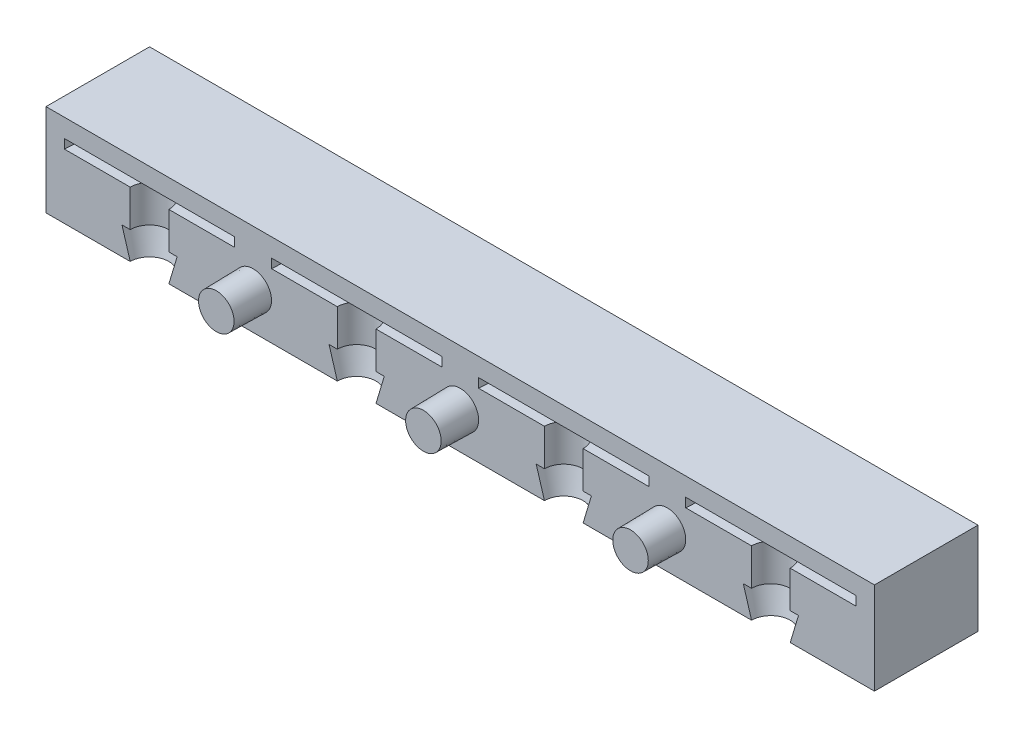
ISO-10303-21;
HEADER;
FILE_DESCRIPTION(('STEP AP214'),'2;1');
FILE_NAME('part.step','',(''),(''),'','','');
FILE_SCHEMA(('AUTOMOTIVE_DESIGN { 1 0 10303 214 1 1 1 1 }'));
ENDSEC;
DATA;
#1=APPLICATION_CONTEXT('core data for automotive mechanical design processes');
#2=APPLICATION_PROTOCOL_DEFINITION('international standard','automotive_design',2000,#1);
#3=PRODUCT_CONTEXT('',#1,'mechanical');
#4=PRODUCT('Part','Part','',(#3));
#5=PRODUCT_RELATED_PRODUCT_CATEGORY('part','',(#4));
#6=PRODUCT_DEFINITION_FORMATION('','',#4);
#7=PRODUCT_DEFINITION_CONTEXT('part definition',#1,'design');
#8=PRODUCT_DEFINITION('design','',#6,#7);
#9=PRODUCT_DEFINITION_SHAPE('','',#8);
#10=(LENGTH_UNIT() NAMED_UNIT(*) SI_UNIT(.MILLI.,.METRE.));
#11=(NAMED_UNIT(*) PLANE_ANGLE_UNIT() SI_UNIT($,.RADIAN.));
#12=(NAMED_UNIT(*) SI_UNIT($,.STERADIAN.) SOLID_ANGLE_UNIT());
#13=UNCERTAINTY_MEASURE_WITH_UNIT(LENGTH_MEASURE(1.E-05),#10,'distance_accuracy_value','');
#14=(GEOMETRIC_REPRESENTATION_CONTEXT(3) GLOBAL_UNCERTAINTY_ASSIGNED_CONTEXT((#13)) GLOBAL_UNIT_ASSIGNED_CONTEXT((#10,
#11,#12)) REPRESENTATION_CONTEXT('',''));
#15=CARTESIAN_POINT('',(0.,0.,0.));
#16=DIRECTION('',(0.,0.,1.));
#17=DIRECTION('',(1.,0.,0.));
#18=AXIS2_PLACEMENT_3D('',#15,#16,#17);
#19=CARTESIAN_POINT('',(45.,10.,-11.2499999999995));
#20=DIRECTION('',(-1.,0.,0.));
#21=DIRECTION('',(0.,0.,1.));
#22=AXIS2_PLACEMENT_3D('',#19,#20,#21);
#23=PLANE('',#22);
#24=DIRECTION('',(0.,0.,-1.));
#25=VECTOR('',#24,1.);
#26=CARTESIAN_POINT('',(45.,0.,-11.2499999999995));
#27=LINE('',#26,#25);
#28=CARTESIAN_POINT('',(45.,0.,4.70402975792114E-13));
#29=VERTEX_POINT('',#28);
#30=CARTESIAN_POINT('',(45.,0.,-11.2499999999995));
#31=VERTEX_POINT('',#30);
#32=EDGE_CURVE('E253',#29,#31,#27,.T.);
#33=ORIENTED_EDGE('',*,*,#32,.T.);
#34=DIRECTION('',(0.,-1.,0.));
#35=VECTOR('',#34,1.);
#36=CARTESIAN_POINT('',(45.,10.,-11.2499999999995));
#37=LINE('',#36,#35);
#38=CARTESIAN_POINT('',(45.,10.,-11.2499999999995));
#39=VERTEX_POINT('',#38);
#40=EDGE_CURVE('E398',#39,#31,#37,.T.);
#41=ORIENTED_EDGE('',*,*,#40,.F.);
#42=DIRECTION('',(0.,0.,-1.));
#43=VECTOR('',#42,1.);
#44=CARTESIAN_POINT('',(45.,10.,-11.2499999999995));
#45=LINE('',#44,#43);
#46=CARTESIAN_POINT('',(45.,10.,4.70402975792114E-13));
#47=VERTEX_POINT('',#46);
#48=EDGE_CURVE('E267',#47,#39,#45,.T.);
#49=ORIENTED_EDGE('',*,*,#48,.F.);
#50=DIRECTION('',(0.,-1.,0.));
#51=VECTOR('',#50,1.);
#52=CARTESIAN_POINT('',(45.,10.,4.70402975792114E-13));
#53=LINE('',#52,#51);
#54=EDGE_CURVE('E386',#47,#29,#53,.T.);
#55=ORIENTED_EDGE('',*,*,#54,.T.);
#56=EDGE_LOOP('',(#33,#41,#49,#55));
#57=FACE_BOUND('',#56,.T.);
#58=ADVANCED_FACE('F39',(#57),#23,.F.);
#59=CARTESIAN_POINT('',(-45.,10.,-11.2499999999996));
#60=DIRECTION('',(0.,0.,1.));
#61=DIRECTION('',(1.,0.,0.));
#62=AXIS2_PLACEMENT_3D('',#59,#60,#61);
#63=PLANE('',#62);
#64=DIRECTION('',(-1.,0.,0.));
#65=VECTOR('',#64,1.);
#66=CARTESIAN_POINT('',(-45.,0.,-11.2499999999996));
#67=LINE('',#66,#65);
#68=CARTESIAN_POINT('',(-45.,0.,-11.2499999999996));
#69=VERTEX_POINT('',#68);
#70=EDGE_CURVE('E262',#31,#69,#67,.T.);
#71=ORIENTED_EDGE('',*,*,#70,.T.);
#72=DIRECTION('',(0.,-1.,0.));
#73=VECTOR('',#72,1.);
#74=CARTESIAN_POINT('',(-45.,10.,-11.2499999999996));
#75=LINE('',#74,#73);
#76=CARTESIAN_POINT('',(-45.,10.,-11.2499999999996));
#77=VERTEX_POINT('',#76);
#78=EDGE_CURVE('E395',#77,#69,#75,.T.);
#79=ORIENTED_EDGE('',*,*,#78,.F.);
#80=DIRECTION('',(-1.,0.,0.));
#81=VECTOR('',#80,1.);
#82=CARTESIAN_POINT('',(-45.,10.,-11.2499999999996));
#83=LINE('',#82,#81);
#84=EDGE_CURVE('E275',#39,#77,#83,.T.);
#85=ORIENTED_EDGE('',*,*,#84,.F.);
#86=ORIENTED_EDGE('',*,*,#40,.T.);
#87=EDGE_LOOP('',(#71,#79,#85,#86));
#88=FACE_BOUND('',#87,.T.);
#89=ADVANCED_FACE('F394',(#88),#63,.F.);
#90=CARTESIAN_POINT('',(-45.,10.,-11.2499999999996));
#91=DIRECTION('',(1.,0.,0.));
#92=DIRECTION('',(0.,0.,-1.));
#93=AXIS2_PLACEMENT_3D('',#90,#91,#92);
#94=PLANE('',#93);
#95=DIRECTION('',(0.,0.,1.));
#96=VECTOR('',#95,1.);
#97=CARTESIAN_POINT('',(-45.,0.,-11.2499999999996));
#98=LINE('',#97,#96);
#99=CARTESIAN_POINT('',(-45.,0.,4.70402975792114E-13));
#100=VERTEX_POINT('',#99);
#101=EDGE_CURVE('E256',#69,#100,#98,.T.);
#102=ORIENTED_EDGE('',*,*,#101,.T.);
#103=DIRECTION('',(0.,-1.,0.));
#104=VECTOR('',#103,1.);
#105=CARTESIAN_POINT('',(-45.,10.,4.70402975792114E-13));
#106=LINE('',#105,#104);
#107=CARTESIAN_POINT('',(-45.,10.,4.70402975792114E-13));
#108=VERTEX_POINT('',#107);
#109=EDGE_CURVE('E404',#108,#100,#106,.T.);
#110=ORIENTED_EDGE('',*,*,#109,.F.);
#111=DIRECTION('',(0.,0.,1.));
#112=VECTOR('',#111,1.);
#113=CARTESIAN_POINT('',(-45.,10.,-11.2499999999996));
#114=LINE('',#113,#112);
#115=EDGE_CURVE('E380',#77,#108,#114,.T.);
#116=ORIENTED_EDGE('',*,*,#115,.F.);
#117=ORIENTED_EDGE('',*,*,#78,.T.);
#118=EDGE_LOOP('',(#102,#110,#116,#117));
#119=FACE_BOUND('',#118,.T.);
#120=ADVANCED_FACE('F401',(#119),#94,.F.);
#121=CARTESIAN_POINT('',(-45.,10.,4.70402975792114E-13));
#122=DIRECTION('',(0.,0.,-1.));
#123=DIRECTION('',(-1.,0.,0.));
#124=AXIS2_PLACEMENT_3D('',#121,#122,#123);
#125=PLANE('',#124);
#126=CARTESIAN_POINT('',(22.5,4.,4.70110061989715E-13));
#127=DIRECTION('',(0.,0.,-1.));
#128=DIRECTION('',(-1.,0.,0.));
#129=AXIS2_PLACEMENT_3D('',#126,#127,#128);
#130=CIRCLE('',#129,2.);
#131=CARTESIAN_POINT('',(20.5,4.,4.70110061989715E-13));
#132=VERTEX_POINT('',#131);
#133=EDGE_CURVE('E11',#132,#132,#130,.F.);
#134=ORIENTED_EDGE('',*,*,#133,.F.);
#135=EDGE_LOOP('',(#134));
#136=FACE_BOUND('',#135,.T.);
#137=CARTESIAN_POINT('',(0.,4.,4.70110061989715E-13));
#138=DIRECTION('',(0.,0.,-1.));
#139=DIRECTION('',(-1.,0.,0.));
#140=AXIS2_PLACEMENT_3D('',#137,#138,#139);
#141=CIRCLE('',#140,2.);
#142=CARTESIAN_POINT('',(-2.,4.,4.70110061989715E-13));
#143=VERTEX_POINT('',#142);
#144=EDGE_CURVE('E49',#143,#143,#141,.F.);
#145=ORIENTED_EDGE('',*,*,#144,.F.);
#146=EDGE_LOOP('',(#145));
#147=FACE_BOUND('',#146,.T.);
#148=CARTESIAN_POINT('',(-22.5,4.,4.70110061989715E-13));
#149=DIRECTION('',(0.,0.,-1.));
#150=DIRECTION('',(-1.,0.,0.));
#151=AXIS2_PLACEMENT_3D('',#148,#149,#150);
#152=CIRCLE('',#151,2.);
#153=CARTESIAN_POINT('',(-24.5,4.,4.70110061989715E-13));
#154=VERTEX_POINT('',#153);
#155=EDGE_CURVE('E524',#154,#154,#152,.F.);
#156=ORIENTED_EDGE('',*,*,#155,.F.);
#157=EDGE_LOOP('',(#156));
#158=FACE_BOUND('',#157,.T.);
#159=DIRECTION('',(1.,0.,0.));
#160=VECTOR('',#159,1.);
#161=CARTESIAN_POINT('',(-45.,0.,4.70402975792114E-13));
#162=LINE('',#161,#160);
#163=CARTESIAN_POINT('',(13.35,0.,4.70402975792114E-13));
#164=VERTEX_POINT('',#163);
#165=CARTESIAN_POINT('',(31.65,0.,4.70402975792114E-13));
#166=VERTEX_POINT('',#165);
#167=EDGE_CURVE('E255',#164,#166,#162,.T.);
#168=ORIENTED_EDGE('',*,*,#167,.T.);
#169=DIRECTION('',(-0.287347885566349,0.95782628522115,0.));
#170=VECTOR('',#169,1.);
#171=CARTESIAN_POINT('',(33.75,-6.99999999999987,4.70402975792114E-13));
#172=LINE('',#171,#170);
#173=CARTESIAN_POINT('',(30.75,3.,4.70402975792114E-13));
#174=VERTEX_POINT('',#173);
#175=EDGE_CURVE('E57',#166,#174,#172,.T.);
#176=ORIENTED_EDGE('',*,*,#175,.T.);
#177=DIRECTION('',(1.,0.,0.));
#178=VECTOR('',#177,1.);
#179=CARTESIAN_POINT('',(-45.,3.,4.70402975792114E-13));
#180=LINE('',#179,#178);
#181=CARTESIAN_POINT('',(31.65,3.,4.70402975792114E-13));
#182=VERTEX_POINT('',#181);
#183=EDGE_CURVE('E500',#174,#182,#180,.T.);
#184=ORIENTED_EDGE('',*,*,#183,.T.);
#185=DIRECTION('',(0.,1.,0.));
#186=VECTOR('',#185,1.);
#187=CARTESIAN_POINT('',(31.65,16.9604957442004,4.70402975792114E-13));
#188=LINE('',#187,#186);
#189=CARTESIAN_POINT('',(31.65,7.,4.70402975792113E-13));
#190=VERTEX_POINT('',#189);
#191=EDGE_CURVE('E520',#182,#190,#188,.T.);
#192=ORIENTED_EDGE('',*,*,#191,.T.);
#193=DIRECTION('',(-1.,0.,0.));
#194=VECTOR('',#193,1.);
#195=CARTESIAN_POINT('',(-45.,7.,4.70402975792114E-13));
#196=LINE('',#195,#194);
#197=CARTESIAN_POINT('',(24.5,7.,4.70402975792114E-13));
#198=VERTEX_POINT('',#197);
#199=EDGE_CURVE('E508',#190,#198,#196,.T.);
#200=ORIENTED_EDGE('',*,*,#199,.T.);
#201=DIRECTION('',(0.,1.,0.));
#202=VECTOR('',#201,1.);
#203=CARTESIAN_POINT('',(24.5,16.9604957442004,4.70402975792114E-13));
#204=LINE('',#203,#202);
#205=CARTESIAN_POINT('',(24.5,8.,4.70402975792114E-13));
#206=VERTEX_POINT('',#205);
#207=EDGE_CURVE('E516',#198,#206,#204,.T.);
#208=ORIENTED_EDGE('',*,*,#207,.T.);
#209=DIRECTION('',(1.,0.,0.));
#210=VECTOR('',#209,1.);
#211=CARTESIAN_POINT('',(-45.,8.,4.70402975792114E-13));
#212=LINE('',#211,#210);
#213=CARTESIAN_POINT('',(43.,8.,4.70402975792114E-13));
#214=VERTEX_POINT('',#213);
#215=EDGE_CURVE('E512',#206,#214,#212,.T.);
#216=ORIENTED_EDGE('',*,*,#215,.T.);
#217=DIRECTION('',(0.,1.,0.));
#218=VECTOR('',#217,1.);
#219=CARTESIAN_POINT('',(43.,16.9604957442004,4.70402975792114E-13));
#220=LINE('',#219,#218);
#221=CARTESIAN_POINT('',(43.,7.,4.70402975792114E-13));
#222=VERTEX_POINT('',#221);
#223=EDGE_CURVE('E507',#214,#222,#220,.F.);
#224=ORIENTED_EDGE('',*,*,#223,.T.);
#225=CARTESIAN_POINT('',(35.85,7.,4.70402975792113E-13));
#226=VERTEX_POINT('',#225);
#227=EDGE_CURVE('E503',#222,#226,#196,.T.);
#228=ORIENTED_EDGE('',*,*,#227,.T.);
#229=DIRECTION('',(0.,1.,0.));
#230=VECTOR('',#229,1.);
#231=CARTESIAN_POINT('',(35.85,16.9604957442004,4.70402975792114E-13));
#232=LINE('',#231,#230);
#233=CARTESIAN_POINT('',(35.85,3.,4.70402975792114E-13));
#234=VERTEX_POINT('',#233);
#235=EDGE_CURVE('E499',#226,#234,#232,.F.);
#236=ORIENTED_EDGE('',*,*,#235,.T.);
#237=CARTESIAN_POINT('',(36.75,3.,4.70402975792114E-13));
#238=VERTEX_POINT('',#237);
#239=EDGE_CURVE('E246',#234,#238,#180,.T.);
#240=ORIENTED_EDGE('',*,*,#239,.T.);
#241=DIRECTION('',(-0.287347885566349,-0.95782628522115,0.));
#242=VECTOR('',#241,1.);
#243=CARTESIAN_POINT('',(33.75,-6.99999999999987,4.70402975792114E-13));
#244=LINE('',#243,#242);
#245=CARTESIAN_POINT('',(35.85,0.,4.70402975792114E-13));
#246=VERTEX_POINT('',#245);
#247=EDGE_CURVE('E229',#238,#246,#244,.T.);
#248=ORIENTED_EDGE('',*,*,#247,.T.);
#249=EDGE_CURVE('E243',#246,#29,#162,.T.);
#250=ORIENTED_EDGE('',*,*,#249,.T.);
#251=ORIENTED_EDGE('',*,*,#54,.F.);
#252=DIRECTION('',(1.,0.,0.));
#253=VECTOR('',#252,1.);
#254=CARTESIAN_POINT('',(-45.,10.,4.70402975792114E-13));
#255=LINE('',#254,#253);
#256=EDGE_CURVE('E383',#108,#47,#255,.T.);
#257=ORIENTED_EDGE('',*,*,#256,.F.);
#258=ORIENTED_EDGE('',*,*,#109,.T.);
#259=CARTESIAN_POINT('',(-35.85,0.,4.70402975792114E-13));
#260=VERTEX_POINT('',#259);
#261=EDGE_CURVE('E258',#100,#260,#162,.T.);
#262=ORIENTED_EDGE('',*,*,#261,.T.);
#263=DIRECTION('',(-0.287347885566349,0.95782628522115,0.));
#264=VECTOR('',#263,1.);
#265=CARTESIAN_POINT('',(-33.75,-6.99999999999987,4.70402975792114E-13));
#266=LINE('',#265,#264);
#267=CARTESIAN_POINT('',(-36.75,3.,4.70402975792114E-13));
#268=VERTEX_POINT('',#267);
#269=EDGE_CURVE('E375',#260,#268,#266,.T.);
#270=ORIENTED_EDGE('',*,*,#269,.T.);
#271=DIRECTION('',(1.,0.,0.));
#272=VECTOR('',#271,1.);
#273=CARTESIAN_POINT('',(-45.,3.,4.70402975792114E-13));
#274=LINE('',#273,#272);
#275=CARTESIAN_POINT('',(-35.85,3.,4.70402975792114E-13));
#276=VERTEX_POINT('',#275);
#277=EDGE_CURVE('E418',#268,#276,#274,.T.);
#278=ORIENTED_EDGE('',*,*,#277,.T.);
#279=DIRECTION('',(0.,1.,0.));
#280=VECTOR('',#279,1.);
#281=CARTESIAN_POINT('',(-35.85,16.9604957442004,4.70402975792114E-13));
#282=LINE('',#281,#280);
#283=CARTESIAN_POINT('',(-35.85,7.,4.70402975792113E-13));
#284=VERTEX_POINT('',#283);
#285=EDGE_CURVE('E427',#276,#284,#282,.T.);
#286=ORIENTED_EDGE('',*,*,#285,.T.);
#287=DIRECTION('',(-1.,0.,0.));
#288=VECTOR('',#287,1.);
#289=CARTESIAN_POINT('',(-45.,7.,4.70402975792114E-13));
#290=LINE('',#289,#288);
#291=CARTESIAN_POINT('',(-43.,7.,4.70402975792114E-13));
#292=VERTEX_POINT('',#291);
#293=EDGE_CURVE('E434',#284,#292,#290,.T.);
#294=ORIENTED_EDGE('',*,*,#293,.T.);
#295=DIRECTION('',(0.,1.,0.));
#296=VECTOR('',#295,1.);
#297=CARTESIAN_POINT('',(-43.,16.9604957442004,4.70402975792114E-13));
#298=LINE('',#297,#296);
#299=CARTESIAN_POINT('',(-43.,8.,4.70402975792114E-13));
#300=VERTEX_POINT('',#299);
#301=EDGE_CURVE('E438',#292,#300,#298,.T.);
#302=ORIENTED_EDGE('',*,*,#301,.T.);
#303=DIRECTION('',(1.,0.,0.));
#304=VECTOR('',#303,1.);
#305=CARTESIAN_POINT('',(-45.,8.,4.70402975792114E-13));
#306=LINE('',#305,#304);
#307=CARTESIAN_POINT('',(-24.5,8.,4.70402975792114E-13));
#308=VERTEX_POINT('',#307);
#309=EDGE_CURVE('E899',#300,#308,#306,.T.);
#310=ORIENTED_EDGE('',*,*,#309,.T.);
#311=DIRECTION('',(0.,1.,0.));
#312=VECTOR('',#311,1.);
#313=CARTESIAN_POINT('',(-24.5,16.9604957442004,4.70402975792114E-13));
#314=LINE('',#313,#312);
#315=CARTESIAN_POINT('',(-24.5,7.,4.70402975792114E-13));
#316=VERTEX_POINT('',#315);
#317=EDGE_CURVE('E902',#308,#316,#314,.F.);
#318=ORIENTED_EDGE('',*,*,#317,.T.);
#319=CARTESIAN_POINT('',(-31.65,7.,4.70402975792113E-13));
#320=VERTEX_POINT('',#319);
#321=EDGE_CURVE('E421',#316,#320,#290,.T.);
#322=ORIENTED_EDGE('',*,*,#321,.T.);
#323=DIRECTION('',(0.,1.,0.));
#324=VECTOR('',#323,1.);
#325=CARTESIAN_POINT('',(-31.65,16.9604957442004,4.70402975792114E-13));
#326=LINE('',#325,#324);
#327=CARTESIAN_POINT('',(-31.65,3.,4.70402975792114E-13));
#328=VERTEX_POINT('',#327);
#329=EDGE_CURVE('E413',#320,#328,#326,.F.);
#330=ORIENTED_EDGE('',*,*,#329,.T.);
#331=CARTESIAN_POINT('',(-30.75,3.,4.70402975792114E-13));
#332=VERTEX_POINT('',#331);
#333=EDGE_CURVE('E411',#328,#332,#274,.T.);
#334=ORIENTED_EDGE('',*,*,#333,.T.);
#335=DIRECTION('',(-0.287347885566349,-0.95782628522115,0.));
#336=VECTOR('',#335,1.);
#337=CARTESIAN_POINT('',(-33.75,-6.99999999999987,4.70402975792114E-13));
#338=LINE('',#337,#336);
#339=CARTESIAN_POINT('',(-31.65,0.,4.70402975792114E-13));
#340=VERTEX_POINT('',#339);
#341=EDGE_CURVE('E372',#332,#340,#338,.T.);
#342=ORIENTED_EDGE('',*,*,#341,.T.);
#343=CARTESIAN_POINT('',(-13.35,0.,4.70402975792114E-13));
#344=VERTEX_POINT('',#343);
#345=EDGE_CURVE('E268',#340,#344,#162,.T.);
#346=ORIENTED_EDGE('',*,*,#345,.T.);
#347=DIRECTION('',(-0.287347885566349,0.95782628522115,0.));
#348=VECTOR('',#347,1.);
#349=CARTESIAN_POINT('',(-11.25,-6.99999999999987,4.70402975792114E-13));
#350=LINE('',#349,#348);
#351=CARTESIAN_POINT('',(-14.25,3.,4.70402975792114E-13));
#352=VERTEX_POINT('',#351);
#353=EDGE_CURVE('E345',#344,#352,#350,.T.);
#354=ORIENTED_EDGE('',*,*,#353,.T.);
#355=DIRECTION('',(1.,0.,0.));
#356=VECTOR('',#355,1.);
#357=CARTESIAN_POINT('',(-45.,3.,4.70402975792114E-13));
#358=LINE('',#357,#356);
#359=CARTESIAN_POINT('',(-13.35,3.,4.70402975792114E-13));
#360=VERTEX_POINT('',#359);
#361=EDGE_CURVE('E433',#352,#360,#358,.T.);
#362=ORIENTED_EDGE('',*,*,#361,.T.);
#363=DIRECTION('',(0.,1.,0.));
#364=VECTOR('',#363,1.);
#365=CARTESIAN_POINT('',(-13.35,16.9604957442004,4.70402975792114E-13));
#366=LINE('',#365,#364);
#367=CARTESIAN_POINT('',(-13.35,7.,4.70402975792114E-13));
#368=VERTEX_POINT('',#367);
#369=EDGE_CURVE('E463',#360,#368,#366,.T.);
#370=ORIENTED_EDGE('',*,*,#369,.T.);
#371=DIRECTION('',(-1.,0.,0.));
#372=VECTOR('',#371,1.);
#373=CARTESIAN_POINT('',(-45.,7.,4.70402975792114E-13));
#374=LINE('',#373,#372);
#375=CARTESIAN_POINT('',(-20.5,7.,4.70402975792114E-13));
#376=VERTEX_POINT('',#375);
#377=EDGE_CURVE('E451',#368,#376,#374,.T.);
#378=ORIENTED_EDGE('',*,*,#377,.T.);
#379=DIRECTION('',(0.,1.,0.));
#380=VECTOR('',#379,1.);
#381=CARTESIAN_POINT('',(-20.5,16.9604957442004,4.70402975792114E-13));
#382=LINE('',#381,#380);
#383=CARTESIAN_POINT('',(-20.5,8.,4.70402975792114E-13));
#384=VERTEX_POINT('',#383);
#385=EDGE_CURVE('E459',#376,#384,#382,.T.);
#386=ORIENTED_EDGE('',*,*,#385,.T.);
#387=DIRECTION('',(1.,0.,0.));
#388=VECTOR('',#387,1.);
#389=CARTESIAN_POINT('',(-45.,8.,4.70402975792114E-13));
#390=LINE('',#389,#388);
#391=CARTESIAN_POINT('',(-2.00000000000001,8.,4.70402975792114E-13));
#392=VERTEX_POINT('',#391);
#393=EDGE_CURVE('E455',#384,#392,#390,.T.);
#394=ORIENTED_EDGE('',*,*,#393,.T.);
#395=DIRECTION('',(0.,1.,0.));
#396=VECTOR('',#395,1.);
#397=CARTESIAN_POINT('',(-2.00000000000001,16.9604957442004,4.70402975792114E-13));
#398=LINE('',#397,#396);
#399=CARTESIAN_POINT('',(-2.00000000000001,7.,4.70402975792114E-13));
#400=VERTEX_POINT('',#399);
#401=EDGE_CURVE('E450',#392,#400,#398,.F.);
#402=ORIENTED_EDGE('',*,*,#401,.T.);
#403=CARTESIAN_POINT('',(-9.15000000000002,7.,4.70402975792114E-13));
#404=VERTEX_POINT('',#403);
#405=EDGE_CURVE('E446',#400,#404,#374,.T.);
#406=ORIENTED_EDGE('',*,*,#405,.T.);
#407=DIRECTION('',(0.,1.,0.));
#408=VECTOR('',#407,1.);
#409=CARTESIAN_POINT('',(-9.15000000000002,16.9604957442004,4.70402975792114E-13));
#410=LINE('',#409,#408);
#411=CARTESIAN_POINT('',(-9.15000000000001,3.,4.70402975792114E-13));
#412=VERTEX_POINT('',#411);
#413=EDGE_CURVE('E431',#404,#412,#410,.F.);
#414=ORIENTED_EDGE('',*,*,#413,.T.);
#415=CARTESIAN_POINT('',(-8.25,3.,4.70402975792114E-13));
#416=VERTEX_POINT('',#415);
#417=EDGE_CURVE('E426',#412,#416,#358,.T.);
#418=ORIENTED_EDGE('',*,*,#417,.T.);
#419=DIRECTION('',(-0.287347885566349,-0.95782628522115,0.));
#420=VECTOR('',#419,1.);
#421=CARTESIAN_POINT('',(-11.25,-6.99999999999987,4.70402975792114E-13));
#422=LINE('',#421,#420);
#423=CARTESIAN_POINT('',(-9.15000000000001,0.,4.70402975792114E-13));
#424=VERTEX_POINT('',#423);
#425=EDGE_CURVE('E287',#416,#424,#422,.T.);
#426=ORIENTED_EDGE('',*,*,#425,.T.);
#427=CARTESIAN_POINT('',(9.15000000000001,0.,4.70402975792114E-13));
#428=VERTEX_POINT('',#427);
#429=EDGE_CURVE('E261',#424,#428,#162,.T.);
#430=ORIENTED_EDGE('',*,*,#429,.T.);
#431=DIRECTION('',(-0.287347885566349,0.95782628522115,0.));
#432=VECTOR('',#431,1.);
#433=CARTESIAN_POINT('',(11.25,-6.99999999999987,4.70402975792114E-13));
#434=LINE('',#433,#432);
#435=CARTESIAN_POINT('',(8.24999999999999,3.,4.70402975792114E-13));
#436=VERTEX_POINT('',#435);
#437=EDGE_CURVE('E65',#428,#436,#434,.T.);
#438=ORIENTED_EDGE('',*,*,#437,.T.);
#439=DIRECTION('',(1.,0.,0.));
#440=VECTOR('',#439,1.);
#441=CARTESIAN_POINT('',(-45.,3.,4.70402975792114E-13));
#442=LINE('',#441,#440);
#443=CARTESIAN_POINT('',(9.15000000000001,3.,4.70402975792114E-13));
#444=VERTEX_POINT('',#443);
#445=EDGE_CURVE('E472',#436,#444,#442,.T.);
#446=ORIENTED_EDGE('',*,*,#445,.T.);
#447=DIRECTION('',(0.,1.,0.));
#448=VECTOR('',#447,1.);
#449=CARTESIAN_POINT('',(9.15000000000001,16.9604957442004,4.70402975792114E-13));
#450=LINE('',#449,#448);
#451=CARTESIAN_POINT('',(9.15000000000001,7.,4.70402975792114E-13));
#452=VERTEX_POINT('',#451);
#453=EDGE_CURVE('E493',#444,#452,#450,.T.);
#454=ORIENTED_EDGE('',*,*,#453,.T.);
#455=DIRECTION('',(-1.,0.,0.));
#456=VECTOR('',#455,1.);
#457=CARTESIAN_POINT('',(-45.,7.,4.70402975792114E-13));
#458=LINE('',#457,#456);
#459=CARTESIAN_POINT('',(2.,7.,4.70402975792114E-13));
#460=VERTEX_POINT('',#459);
#461=EDGE_CURVE('E481',#452,#460,#458,.T.);
#462=ORIENTED_EDGE('',*,*,#461,.T.);
#463=DIRECTION('',(0.,1.,0.));
#464=VECTOR('',#463,1.);
#465=CARTESIAN_POINT('',(2.,16.9604957442004,4.70402975792114E-13));
#466=LINE('',#465,#464);
#467=CARTESIAN_POINT('',(2.,8.,4.70402975792114E-13));
#468=VERTEX_POINT('',#467);
#469=EDGE_CURVE('E489',#460,#468,#466,.T.);
#470=ORIENTED_EDGE('',*,*,#469,.T.);
#471=DIRECTION('',(1.,0.,0.));
#472=VECTOR('',#471,1.);
#473=CARTESIAN_POINT('',(-45.,8.,4.70402975792114E-13));
#474=LINE('',#473,#472);
#475=CARTESIAN_POINT('',(20.5,8.,4.70402975792114E-13));
#476=VERTEX_POINT('',#475);
#477=EDGE_CURVE('E485',#468,#476,#474,.T.);
#478=ORIENTED_EDGE('',*,*,#477,.T.);
#479=DIRECTION('',(0.,1.,0.));
#480=VECTOR('',#479,1.);
#481=CARTESIAN_POINT('',(20.5,16.9604957442004,4.70402975792114E-13));
#482=LINE('',#481,#480);
#483=CARTESIAN_POINT('',(20.5,7.,4.70402975792114E-13));
#484=VERTEX_POINT('',#483);
#485=EDGE_CURVE('E480',#476,#484,#482,.F.);
#486=ORIENTED_EDGE('',*,*,#485,.T.);
#487=CARTESIAN_POINT('',(13.35,7.,4.70402975792114E-13));
#488=VERTEX_POINT('',#487);
#489=EDGE_CURVE('E476',#484,#488,#458,.T.);
#490=ORIENTED_EDGE('',*,*,#489,.T.);
#491=DIRECTION('',(0.,1.,0.));
#492=VECTOR('',#491,1.);
#493=CARTESIAN_POINT('',(13.35,16.9604957442004,4.70402975792114E-13));
#494=LINE('',#493,#492);
#495=CARTESIAN_POINT('',(13.35,3.,4.70402975792114E-13));
#496=VERTEX_POINT('',#495);
#497=EDGE_CURVE('E471',#488,#496,#494,.F.);
#498=ORIENTED_EDGE('',*,*,#497,.T.);
#499=CARTESIAN_POINT('',(14.25,3.,4.70402975792114E-13));
#500=VERTEX_POINT('',#499);
#501=EDGE_CURVE('E467',#496,#500,#442,.T.);
#502=ORIENTED_EDGE('',*,*,#501,.T.);
#503=DIRECTION('',(-0.287347885566349,-0.95782628522115,0.));
#504=VECTOR('',#503,1.);
#505=CARTESIAN_POINT('',(11.25,-6.99999999999987,4.70402975792114E-13));
#506=LINE('',#505,#504);
#507=EDGE_CURVE('E316',#500,#164,#506,.T.);
#508=ORIENTED_EDGE('',*,*,#507,.T.);
#509=EDGE_LOOP('',(#168,#176,#184,#192,#200,#208,#216,#224,#228,#236,#240,#248,#250,#251,#257,
#258,#262,#270,#278,#286,#294,#302,#310,#318,#322,#330,#334,#342,#346,#354,#362,#370,#378,#386,
#394,#402,#406,#414,#418,#426,#430,#438,#446,#454,#462,#470,#478,#486,#490,#498,#502,#508));
#510=FACE_BOUND('',#509,.T.);
#511=ADVANCED_FACE('F241',(#136,#147,#158,#510),#125,.F.);
#512=CARTESIAN_POINT('',(0.,10.,0.));
#513=DIRECTION('',(0.,1.,0.));
#514=DIRECTION('',(0.,0.,1.));
#515=AXIS2_PLACEMENT_3D('',#512,#513,#514);
#516=PLANE('',#515);
#517=ORIENTED_EDGE('',*,*,#48,.T.);
#518=ORIENTED_EDGE('',*,*,#84,.T.);
#519=ORIENTED_EDGE('',*,*,#115,.T.);
#520=ORIENTED_EDGE('',*,*,#256,.T.);
#521=EDGE_LOOP('',(#517,#518,#519,#520));
#522=FACE_BOUND('',#521,.T.);
#523=ADVANCED_FACE('F552',(#522),#516,.T.);
#524=CARTESIAN_POINT('',(0.,0.,0.));
#525=DIRECTION('',(0.,1.,0.));
#526=DIRECTION('',(0.,0.,1.));
#527=AXIS2_PLACEMENT_3D('',#524,#525,#526);
#528=PLANE('',#527);
#529=ORIENTED_EDGE('',*,*,#249,.F.);
#530=CARTESIAN_POINT('',(33.75,0.,0.));
#531=DIRECTION('',(0.,1.,0.));
#532=DIRECTION('',(0.,0.,1.));
#533=AXIS2_PLACEMENT_3D('',#530,#531,#532);
#534=CIRCLE('',#533,2.09999999999999);
#535=EDGE_CURVE('E226',#246,#166,#534,.T.);
#536=ORIENTED_EDGE('',*,*,#535,.T.);
#537=ORIENTED_EDGE('',*,*,#167,.F.);
#538=CARTESIAN_POINT('',(11.25,0.,0.));
#539=DIRECTION('',(0.,1.,0.));
#540=DIRECTION('',(0.,0.,1.));
#541=AXIS2_PLACEMENT_3D('',#538,#539,#540);
#542=CIRCLE('',#541,2.09999999999999);
#543=EDGE_CURVE('E290',#164,#428,#542,.T.);
#544=ORIENTED_EDGE('',*,*,#543,.T.);
#545=ORIENTED_EDGE('',*,*,#429,.F.);
#546=CARTESIAN_POINT('',(-11.25,0.,0.));
#547=DIRECTION('',(0.,1.,0.));
#548=DIRECTION('',(0.,0.,1.));
#549=AXIS2_PLACEMENT_3D('',#546,#547,#548);
#550=CIRCLE('',#549,2.09999999999999);
#551=EDGE_CURVE('E289',#424,#344,#550,.T.);
#552=ORIENTED_EDGE('',*,*,#551,.T.);
#553=ORIENTED_EDGE('',*,*,#345,.F.);
#554=CARTESIAN_POINT('',(-33.75,0.,0.));
#555=DIRECTION('',(0.,1.,0.));
#556=DIRECTION('',(0.,0.,1.));
#557=AXIS2_PLACEMENT_3D('',#554,#555,#556);
#558=CIRCLE('',#557,2.09999999999999);
#559=EDGE_CURVE('E348',#340,#260,#558,.T.);
#560=ORIENTED_EDGE('',*,*,#559,.T.);
#561=ORIENTED_EDGE('',*,*,#261,.F.);
#562=ORIENTED_EDGE('',*,*,#101,.F.);
#563=ORIENTED_EDGE('',*,*,#70,.F.);
#564=ORIENTED_EDGE('',*,*,#32,.F.);
#565=EDGE_LOOP('',(#529,#536,#537,#544,#545,#552,#553,#560,#561,#562,#563,#564));
#566=FACE_BOUND('',#565,.T.);
#567=ADVANCED_FACE('F251',(#566),#528,.F.);
#568=CARTESIAN_POINT('',(-33.75,8.,0.));
#569=DIRECTION('',(0.,1.,0.));
#570=DIRECTION('',(0.,0.,1.));
#571=AXIS2_PLACEMENT_3D('',#568,#569,#570);
#572=PLANE('',#571);
#573=CARTESIAN_POINT('',(-33.75,8.,0.));
#574=DIRECTION('',(0.,1.,0.));
#575=DIRECTION('',(0.,0.,1.));
#576=AXIS2_PLACEMENT_3D('',#573,#574,#575);
#577=CIRCLE('',#576,9.24999999999999);
#578=EDGE_CURVE('E368',#308,#300,#577,.T.);
#579=ORIENTED_EDGE('',*,*,#578,.F.);
#580=ORIENTED_EDGE('',*,*,#309,.F.);
#581=EDGE_LOOP('',(#579,#580));
#582=FACE_BOUND('',#581,.T.);
#583=ADVANCED_FACE('F674',(#582),#572,.F.);
#584=CARTESIAN_POINT('',(-33.75,16.9604957442004,0.));
#585=DIRECTION('',(0.,1.,0.));
#586=DIRECTION('',(0.,0.,1.));
#587=AXIS2_PLACEMENT_3D('',#584,#585,#586);
#588=CYLINDRICAL_SURFACE('',#587,9.24999999999999);
#589=CARTESIAN_POINT('',(-33.75,7.,0.));
#590=DIRECTION('',(0.,1.,0.));
#591=DIRECTION('',(0.,0.,1.));
#592=AXIS2_PLACEMENT_3D('',#589,#590,#591);
#593=CIRCLE('',#592,9.24999999999999);
#594=EDGE_CURVE('E364',#316,#292,#593,.T.);
#595=ORIENTED_EDGE('',*,*,#594,.F.);
#596=ORIENTED_EDGE('',*,*,#317,.F.);
#597=ORIENTED_EDGE('',*,*,#578,.T.);
#598=ORIENTED_EDGE('',*,*,#301,.F.);
#599=EDGE_LOOP('',(#595,#596,#597,#598));
#600=FACE_BOUND('',#599,.T.);
#601=ADVANCED_FACE('F670',(#600),#588,.F.);
#602=CARTESIAN_POINT('',(-43.,7.,0.));
#603=DIRECTION('',(0.,-1.,0.));
#604=DIRECTION('',(0.,0.,-1.));
#605=AXIS2_PLACEMENT_3D('',#602,#603,#604);
#606=PLANE('',#605);
#607=ORIENTED_EDGE('',*,*,#594,.T.);
#608=ORIENTED_EDGE('',*,*,#293,.F.);
#609=CARTESIAN_POINT('',(-33.75,7.,0.));
#610=DIRECTION('',(0.,1.,0.));
#611=DIRECTION('',(0.,0.,1.));
#612=AXIS2_PLACEMENT_3D('',#609,#610,#611);
#613=CIRCLE('',#612,2.09999999999998);
#614=EDGE_CURVE('E360',#320,#284,#613,.T.);
#615=ORIENTED_EDGE('',*,*,#614,.F.);
#616=ORIENTED_EDGE('',*,*,#321,.F.);
#617=EDGE_LOOP('',(#607,#608,#615,#616));
#618=FACE_BOUND('',#617,.T.);
#619=ADVANCED_FACE('F666',(#618),#606,.F.);
#620=CARTESIAN_POINT('',(-33.75,16.9604957442004,0.));
#621=DIRECTION('',(0.,1.,0.));
#622=DIRECTION('',(0.,0.,1.));
#623=AXIS2_PLACEMENT_3D('',#620,#621,#622);
#624=CYLINDRICAL_SURFACE('',#623,2.09999999999999);
#625=CARTESIAN_POINT('',(-33.75,3.,0.));
#626=DIRECTION('',(0.,1.,0.));
#627=DIRECTION('',(0.,0.,1.));
#628=AXIS2_PLACEMENT_3D('',#625,#626,#627);
#629=CIRCLE('',#628,2.09999999999999);
#630=EDGE_CURVE('E356',#328,#276,#629,.T.);
#631=ORIENTED_EDGE('',*,*,#630,.F.);
#632=ORIENTED_EDGE('',*,*,#329,.F.);
#633=ORIENTED_EDGE('',*,*,#614,.T.);
#634=ORIENTED_EDGE('',*,*,#285,.F.);
#635=EDGE_LOOP('',(#631,#632,#633,#634));
#636=FACE_BOUND('',#635,.T.);
#637=ADVANCED_FACE('F663',(#636),#624,.F.);
#638=CARTESIAN_POINT('',(-35.85,3.,0.));
#639=DIRECTION('',(0.,1.,0.));
#640=DIRECTION('',(0.,0.,1.));
#641=AXIS2_PLACEMENT_3D('',#638,#639,#640);
#642=PLANE('',#641);
#643=CARTESIAN_POINT('',(-33.75,3.,0.));
#644=DIRECTION('',(0.,1.,0.));
#645=DIRECTION('',(0.,0.,1.));
#646=AXIS2_PLACEMENT_3D('',#643,#644,#645);
#647=CIRCLE('',#646,3.);
#648=EDGE_CURVE('E352',#332,#268,#647,.T.);
#649=ORIENTED_EDGE('',*,*,#648,.F.);
#650=ORIENTED_EDGE('',*,*,#333,.F.);
#651=ORIENTED_EDGE('',*,*,#630,.T.);
#652=ORIENTED_EDGE('',*,*,#277,.F.);
#653=EDGE_LOOP('',(#649,#650,#651,#652));
#654=FACE_BOUND('',#653,.T.);
#655=ADVANCED_FACE('F660',(#654),#642,.F.);
#656=CARTESIAN_POINT('',(-33.75,3.,0.));
#657=DIRECTION('',(0.,1.,0.));
#658=DIRECTION('',(0.,0.,1.));
#659=AXIS2_PLACEMENT_3D('',#656,#657,#658);
#660=CONICAL_SURFACE('',#659,3.,0.291456794477871);
#661=ORIENTED_EDGE('',*,*,#559,.F.);
#662=ORIENTED_EDGE('',*,*,#341,.F.);
#663=ORIENTED_EDGE('',*,*,#648,.T.);
#664=ORIENTED_EDGE('',*,*,#269,.F.);
#665=EDGE_LOOP('',(#661,#662,#663,#664));
#666=FACE_BOUND('',#665,.T.);
#667=ADVANCED_FACE('F407',(#666),#660,.F.);
#668=CARTESIAN_POINT('',(-11.25,8.,0.));
#669=DIRECTION('',(0.,1.,0.));
#670=DIRECTION('',(0.,0.,1.));
#671=AXIS2_PLACEMENT_3D('',#668,#669,#670);
#672=PLANE('',#671);
#673=CARTESIAN_POINT('',(-11.25,8.,0.));
#674=DIRECTION('',(0.,1.,0.));
#675=DIRECTION('',(0.,0.,1.));
#676=AXIS2_PLACEMENT_3D('',#673,#674,#675);
#677=CIRCLE('',#676,9.24999999999999);
#678=EDGE_CURVE('E339',#392,#384,#677,.T.);
#679=ORIENTED_EDGE('',*,*,#678,.F.);
#680=ORIENTED_EDGE('',*,*,#393,.F.);
#681=EDGE_LOOP('',(#679,#680));
#682=FACE_BOUND('',#681,.T.);
#683=ADVANCED_FACE('F653',(#682),#672,.F.);
#684=CARTESIAN_POINT('',(-11.25,16.9604957442004,0.));
#685=DIRECTION('',(0.,1.,0.));
#686=DIRECTION('',(0.,0.,1.));
#687=AXIS2_PLACEMENT_3D('',#684,#685,#686);
#688=CYLINDRICAL_SURFACE('',#687,9.24999999999999);
#689=CARTESIAN_POINT('',(-11.25,7.,0.));
#690=DIRECTION('',(0.,1.,0.));
#691=DIRECTION('',(0.,0.,1.));
#692=AXIS2_PLACEMENT_3D('',#689,#690,#691);
#693=CIRCLE('',#692,9.24999999999999);
#694=EDGE_CURVE('E335',#400,#376,#693,.T.);
#695=ORIENTED_EDGE('',*,*,#694,.F.);
#696=ORIENTED_EDGE('',*,*,#401,.F.);
#697=ORIENTED_EDGE('',*,*,#678,.T.);
#698=ORIENTED_EDGE('',*,*,#385,.F.);
#699=EDGE_LOOP('',(#695,#696,#697,#698));
#700=FACE_BOUND('',#699,.T.);
#701=ADVANCED_FACE('F649',(#700),#688,.F.);
#702=CARTESIAN_POINT('',(-20.5,7.,0.));
#703=DIRECTION('',(0.,-1.,0.));
#704=DIRECTION('',(0.,0.,-1.));
#705=AXIS2_PLACEMENT_3D('',#702,#703,#704);
#706=PLANE('',#705);
#707=ORIENTED_EDGE('',*,*,#694,.T.);
#708=ORIENTED_EDGE('',*,*,#377,.F.);
#709=CARTESIAN_POINT('',(-11.25,7.,0.));
#710=DIRECTION('',(0.,1.,0.));
#711=DIRECTION('',(0.,0.,1.));
#712=AXIS2_PLACEMENT_3D('',#709,#710,#711);
#713=CIRCLE('',#712,2.09999999999998);
#714=EDGE_CURVE('E331',#404,#368,#713,.T.);
#715=ORIENTED_EDGE('',*,*,#714,.F.);
#716=ORIENTED_EDGE('',*,*,#405,.F.);
#717=EDGE_LOOP('',(#707,#708,#715,#716));
#718=FACE_BOUND('',#717,.T.);
#719=ADVANCED_FACE('F645',(#718),#706,.F.);
#720=CARTESIAN_POINT('',(-11.25,16.9604957442004,0.));
#721=DIRECTION('',(0.,1.,0.));
#722=DIRECTION('',(0.,0.,1.));
#723=AXIS2_PLACEMENT_3D('',#720,#721,#722);
#724=CYLINDRICAL_SURFACE('',#723,2.09999999999999);
#725=CARTESIAN_POINT('',(-11.25,3.,0.));
#726=DIRECTION('',(0.,1.,0.));
#727=DIRECTION('',(0.,0.,1.));
#728=AXIS2_PLACEMENT_3D('',#725,#726,#727);
#729=CIRCLE('',#728,2.09999999999999);
#730=EDGE_CURVE('E327',#412,#360,#729,.T.);
#731=ORIENTED_EDGE('',*,*,#730,.F.);
#732=ORIENTED_EDGE('',*,*,#413,.F.);
#733=ORIENTED_EDGE('',*,*,#714,.T.);
#734=ORIENTED_EDGE('',*,*,#369,.F.);
#735=EDGE_LOOP('',(#731,#732,#733,#734));
#736=FACE_BOUND('',#735,.T.);
#737=ADVANCED_FACE('F641',(#736),#724,.F.);
#738=CARTESIAN_POINT('',(-13.35,3.,0.));
#739=DIRECTION('',(0.,1.,0.));
#740=DIRECTION('',(0.,0.,1.));
#741=AXIS2_PLACEMENT_3D('',#738,#739,#740);
#742=PLANE('',#741);
#743=CARTESIAN_POINT('',(-11.25,3.,0.));
#744=DIRECTION('',(0.,1.,0.));
#745=DIRECTION('',(0.,0.,1.));
#746=AXIS2_PLACEMENT_3D('',#743,#744,#745);
#747=CIRCLE('',#746,3.);
#748=EDGE_CURVE('E323',#416,#352,#747,.T.);
#749=ORIENTED_EDGE('',*,*,#748,.F.);
#750=ORIENTED_EDGE('',*,*,#417,.F.);
#751=ORIENTED_EDGE('',*,*,#730,.T.);
#752=ORIENTED_EDGE('',*,*,#361,.F.);
#753=EDGE_LOOP('',(#749,#750,#751,#752));
#754=FACE_BOUND('',#753,.T.);
#755=ADVANCED_FACE('F637',(#754),#742,.F.);
#756=CARTESIAN_POINT('',(-11.25,3.,0.));
#757=DIRECTION('',(0.,1.,0.));
#758=DIRECTION('',(0.,0.,1.));
#759=AXIS2_PLACEMENT_3D('',#756,#757,#758);
#760=CONICAL_SURFACE('',#759,3.,0.291456794477871);
#761=ORIENTED_EDGE('',*,*,#551,.F.);
#762=ORIENTED_EDGE('',*,*,#425,.F.);
#763=ORIENTED_EDGE('',*,*,#748,.T.);
#764=ORIENTED_EDGE('',*,*,#353,.F.);
#765=EDGE_LOOP('',(#761,#762,#763,#764));
#766=FACE_BOUND('',#765,.T.);
#767=ADVANCED_FACE('F633',(#766),#760,.F.);
#768=CARTESIAN_POINT('',(11.25,8.,0.));
#769=DIRECTION('',(0.,1.,0.));
#770=DIRECTION('',(0.,0.,1.));
#771=AXIS2_PLACEMENT_3D('',#768,#769,#770);
#772=PLANE('',#771);
#773=CARTESIAN_POINT('',(11.25,8.,0.));
#774=DIRECTION('',(0.,1.,0.));
#775=DIRECTION('',(0.,0.,1.));
#776=AXIS2_PLACEMENT_3D('',#773,#774,#775);
#777=CIRCLE('',#776,9.24999999999999);
#778=EDGE_CURVE('E312',#476,#468,#777,.T.);
#779=ORIENTED_EDGE('',*,*,#778,.F.);
#780=ORIENTED_EDGE('',*,*,#477,.F.);
#781=EDGE_LOOP('',(#779,#780));
#782=FACE_BOUND('',#781,.T.);
#783=ADVANCED_FACE('F629',(#782),#772,.F.);
#784=CARTESIAN_POINT('',(11.25,16.9604957442004,0.));
#785=DIRECTION('',(0.,1.,0.));
#786=DIRECTION('',(0.,0.,1.));
#787=AXIS2_PLACEMENT_3D('',#784,#785,#786);
#788=CYLINDRICAL_SURFACE('',#787,9.24999999999999);
#789=CARTESIAN_POINT('',(11.25,7.,0.));
#790=DIRECTION('',(0.,1.,0.));
#791=DIRECTION('',(0.,0.,1.));
#792=AXIS2_PLACEMENT_3D('',#789,#790,#791);
#793=CIRCLE('',#792,9.24999999999999);
#794=EDGE_CURVE('E308',#484,#460,#793,.T.);
#795=ORIENTED_EDGE('',*,*,#794,.F.);
#796=ORIENTED_EDGE('',*,*,#485,.F.);
#797=ORIENTED_EDGE('',*,*,#778,.T.);
#798=ORIENTED_EDGE('',*,*,#469,.F.);
#799=EDGE_LOOP('',(#795,#796,#797,#798));
#800=FACE_BOUND('',#799,.T.);
#801=ADVANCED_FACE('F625',(#800),#788,.F.);
#802=CARTESIAN_POINT('',(2.,7.,0.));
#803=DIRECTION('',(0.,-1.,0.));
#804=DIRECTION('',(0.,0.,-1.));
#805=AXIS2_PLACEMENT_3D('',#802,#803,#804);
#806=PLANE('',#805);
#807=ORIENTED_EDGE('',*,*,#794,.T.);
#808=ORIENTED_EDGE('',*,*,#461,.F.);
#809=CARTESIAN_POINT('',(11.25,7.,0.));
#810=DIRECTION('',(0.,1.,0.));
#811=DIRECTION('',(0.,0.,1.));
#812=AXIS2_PLACEMENT_3D('',#809,#810,#811);
#813=CIRCLE('',#812,2.09999999999998);
#814=EDGE_CURVE('E304',#488,#452,#813,.T.);
#815=ORIENTED_EDGE('',*,*,#814,.F.);
#816=ORIENTED_EDGE('',*,*,#489,.F.);
#817=EDGE_LOOP('',(#807,#808,#815,#816));
#818=FACE_BOUND('',#817,.T.);
#819=ADVANCED_FACE('F621',(#818),#806,.F.);
#820=CARTESIAN_POINT('',(11.25,16.9604957442004,0.));
#821=DIRECTION('',(0.,1.,0.));
#822=DIRECTION('',(0.,0.,1.));
#823=AXIS2_PLACEMENT_3D('',#820,#821,#822);
#824=CYLINDRICAL_SURFACE('',#823,2.09999999999999);
#825=CARTESIAN_POINT('',(11.25,3.,0.));
#826=DIRECTION('',(0.,1.,0.));
#827=DIRECTION('',(0.,0.,1.));
#828=AXIS2_PLACEMENT_3D('',#825,#826,#827);
#829=CIRCLE('',#828,2.09999999999999);
#830=EDGE_CURVE('E297',#496,#444,#829,.T.);
#831=ORIENTED_EDGE('',*,*,#830,.F.);
#832=ORIENTED_EDGE('',*,*,#497,.F.);
#833=ORIENTED_EDGE('',*,*,#814,.T.);
#834=ORIENTED_EDGE('',*,*,#453,.F.);
#835=EDGE_LOOP('',(#831,#832,#833,#834));
#836=FACE_BOUND('',#835,.T.);
#837=ADVANCED_FACE('F617',(#836),#824,.F.);
#838=CARTESIAN_POINT('',(9.15000000000001,3.,0.));
#839=DIRECTION('',(0.,1.,0.));
#840=DIRECTION('',(0.,0.,1.));
#841=AXIS2_PLACEMENT_3D('',#838,#839,#840);
#842=PLANE('',#841);
#843=CARTESIAN_POINT('',(11.25,3.,0.));
#844=DIRECTION('',(0.,1.,0.));
#845=DIRECTION('',(0.,0.,1.));
#846=AXIS2_PLACEMENT_3D('',#843,#844,#845);
#847=CIRCLE('',#846,3.);
#848=EDGE_CURVE('E293',#500,#436,#847,.T.);
#849=ORIENTED_EDGE('',*,*,#848,.F.);
#850=ORIENTED_EDGE('',*,*,#501,.F.);
#851=ORIENTED_EDGE('',*,*,#830,.T.);
#852=ORIENTED_EDGE('',*,*,#445,.F.);
#853=EDGE_LOOP('',(#849,#850,#851,#852));
#854=FACE_BOUND('',#853,.T.);
#855=ADVANCED_FACE('F614',(#854),#842,.F.);
#856=CARTESIAN_POINT('',(11.25,3.,0.));
#857=DIRECTION('',(0.,1.,0.));
#858=DIRECTION('',(0.,0.,1.));
#859=AXIS2_PLACEMENT_3D('',#856,#857,#858);
#860=CONICAL_SURFACE('',#859,3.,0.291456794477871);
#861=ORIENTED_EDGE('',*,*,#543,.F.);
#862=ORIENTED_EDGE('',*,*,#507,.F.);
#863=ORIENTED_EDGE('',*,*,#848,.T.);
#864=ORIENTED_EDGE('',*,*,#437,.F.);
#865=EDGE_LOOP('',(#861,#862,#863,#864));
#866=FACE_BOUND('',#865,.T.);
#867=ADVANCED_FACE('F610',(#866),#860,.F.);
#868=CARTESIAN_POINT('',(33.75,8.,0.));
#869=DIRECTION('',(0.,1.,0.));
#870=DIRECTION('',(0.,0.,1.));
#871=AXIS2_PLACEMENT_3D('',#868,#869,#870);
#872=PLANE('',#871);
#873=CARTESIAN_POINT('',(33.75,8.,0.));
#874=DIRECTION('',(0.,1.,0.));
#875=DIRECTION('',(0.,0.,1.));
#876=AXIS2_PLACEMENT_3D('',#873,#874,#875);
#877=CIRCLE('',#876,9.24999999999999);
#878=EDGE_CURVE('E248',#214,#206,#877,.T.);
#879=ORIENTED_EDGE('',*,*,#878,.F.);
#880=ORIENTED_EDGE('',*,*,#215,.F.);
#881=EDGE_LOOP('',(#879,#880));
#882=FACE_BOUND('',#881,.T.);
#883=ADVANCED_FACE('F606',(#882),#872,.F.);
#884=CARTESIAN_POINT('',(33.75,16.9604957442004,0.));
#885=DIRECTION('',(0.,1.,0.));
#886=DIRECTION('',(0.,0.,1.));
#887=AXIS2_PLACEMENT_3D('',#884,#885,#886);
#888=CYLINDRICAL_SURFACE('',#887,9.24999999999999);
#889=CARTESIAN_POINT('',(33.75,7.,0.));
#890=DIRECTION('',(0.,1.,0.));
#891=DIRECTION('',(0.,0.,1.));
#892=AXIS2_PLACEMENT_3D('',#889,#890,#891);
#893=CIRCLE('',#892,9.24999999999999);
#894=EDGE_CURVE('E938',#222,#198,#893,.T.);
#895=ORIENTED_EDGE('',*,*,#894,.F.);
#896=ORIENTED_EDGE('',*,*,#223,.F.);
#897=ORIENTED_EDGE('',*,*,#878,.T.);
#898=ORIENTED_EDGE('',*,*,#207,.F.);
#899=EDGE_LOOP('',(#895,#896,#897,#898));
#900=FACE_BOUND('',#899,.T.);
#901=ADVANCED_FACE('F602',(#900),#888,.F.);
#902=CARTESIAN_POINT('',(24.5,7.,0.));
#903=DIRECTION('',(0.,-1.,0.));
#904=DIRECTION('',(0.,0.,-1.));
#905=AXIS2_PLACEMENT_3D('',#902,#903,#904);
#906=PLANE('',#905);
#907=ORIENTED_EDGE('',*,*,#894,.T.);
#908=ORIENTED_EDGE('',*,*,#199,.F.);
#909=CARTESIAN_POINT('',(33.75,7.,0.));
#910=DIRECTION('',(0.,1.,0.));
#911=DIRECTION('',(0.,0.,1.));
#912=AXIS2_PLACEMENT_3D('',#909,#910,#911);
#913=CIRCLE('',#912,2.09999999999998);
#914=EDGE_CURVE('E932',#226,#190,#913,.T.);
#915=ORIENTED_EDGE('',*,*,#914,.F.);
#916=ORIENTED_EDGE('',*,*,#227,.F.);
#917=EDGE_LOOP('',(#907,#908,#915,#916));
#918=FACE_BOUND('',#917,.T.);
#919=ADVANCED_FACE('F598',(#918),#906,.F.);
#920=CARTESIAN_POINT('',(33.75,16.9604957442004,0.));
#921=DIRECTION('',(0.,1.,0.));
#922=DIRECTION('',(0.,0.,1.));
#923=AXIS2_PLACEMENT_3D('',#920,#921,#922);
#924=CYLINDRICAL_SURFACE('',#923,2.09999999999999);
#925=CARTESIAN_POINT('',(33.75,3.,0.));
#926=DIRECTION('',(0.,1.,0.));
#927=DIRECTION('',(0.,0.,1.));
#928=AXIS2_PLACEMENT_3D('',#925,#926,#927);
#929=CIRCLE('',#928,2.09999999999999);
#930=EDGE_CURVE('E928',#234,#182,#929,.T.);
#931=ORIENTED_EDGE('',*,*,#930,.F.);
#932=ORIENTED_EDGE('',*,*,#235,.F.);
#933=ORIENTED_EDGE('',*,*,#914,.T.);
#934=ORIENTED_EDGE('',*,*,#191,.F.);
#935=EDGE_LOOP('',(#931,#932,#933,#934));
#936=FACE_BOUND('',#935,.T.);
#937=ADVANCED_FACE('F594',(#936),#924,.F.);
#938=CARTESIAN_POINT('',(31.65,3.,0.));
#939=DIRECTION('',(0.,1.,0.));
#940=DIRECTION('',(0.,0.,1.));
#941=AXIS2_PLACEMENT_3D('',#938,#939,#940);
#942=PLANE('',#941);
#943=CARTESIAN_POINT('',(33.75,3.,0.));
#944=DIRECTION('',(0.,1.,0.));
#945=DIRECTION('',(0.,0.,1.));
#946=AXIS2_PLACEMENT_3D('',#943,#944,#945);
#947=CIRCLE('',#946,3.);
#948=EDGE_CURVE('E236',#238,#174,#947,.T.);
#949=ORIENTED_EDGE('',*,*,#948,.F.);
#950=ORIENTED_EDGE('',*,*,#239,.F.);
#951=ORIENTED_EDGE('',*,*,#930,.T.);
#952=ORIENTED_EDGE('',*,*,#183,.F.);
#953=EDGE_LOOP('',(#949,#950,#951,#952));
#954=FACE_BOUND('',#953,.T.);
#955=ADVANCED_FACE('F564',(#954),#942,.F.);
#956=CARTESIAN_POINT('',(33.75,3.,0.));
#957=DIRECTION('',(0.,1.,0.));
#958=DIRECTION('',(0.,0.,1.));
#959=AXIS2_PLACEMENT_3D('',#956,#957,#958);
#960=CONICAL_SURFACE('',#959,3.,0.291456794477871);
#961=ORIENTED_EDGE('',*,*,#535,.F.);
#962=ORIENTED_EDGE('',*,*,#247,.F.);
#963=ORIENTED_EDGE('',*,*,#948,.T.);
#964=ORIENTED_EDGE('',*,*,#175,.F.);
#965=EDGE_LOOP('',(#961,#962,#963,#964));
#966=FACE_BOUND('',#965,.T.);
#967=ADVANCED_FACE('F228',(#966),#960,.F.);
#968=CARTESIAN_POINT('',(-22.5,4.,4.70110061989715E-13));
#969=DIRECTION('',(0.,0.,-1.));
#970=DIRECTION('',(-1.,0.,0.));
#971=AXIS2_PLACEMENT_3D('',#968,#969,#970);
#972=CONICAL_SURFACE('',#971,2.,0.0174532925199433);
#973=CARTESIAN_POINT('',(-22.5,4.,4.));
#974=DIRECTION('',(0.,0.,1.));
#975=DIRECTION('',(1.,0.,0.));
#976=AXIS2_PLACEMENT_3D('',#973,#974,#975);
#977=CIRCLE('',#976,1.93017974028714);
#978=CARTESIAN_POINT('',(-20.5698202597129,4.,4.));
#979=VERTEX_POINT('',#978);
#980=EDGE_CURVE('E237',#979,#979,#977,.T.);
#981=ORIENTED_EDGE('',*,*,#980,.F.);
#982=EDGE_LOOP('',(#981));
#983=FACE_BOUND('',#982,.T.);
#984=ORIENTED_EDGE('',*,*,#155,.T.);
#985=EDGE_LOOP('',(#984));
#986=FACE_BOUND('',#985,.T.);
#987=ADVANCED_FACE('F41',(#983,#986),#972,.T.);
#988=CARTESIAN_POINT('',(-22.5,4.,4.));
#989=DIRECTION('',(0.,0.,1.));
#990=DIRECTION('',(1.,0.,0.));
#991=AXIS2_PLACEMENT_3D('',#988,#989,#990);
#992=PLANE('',#991);
#993=ORIENTED_EDGE('',*,*,#980,.T.);
#994=EDGE_LOOP('',(#993));
#995=FACE_BOUND('',#994,.T.);
#996=ADVANCED_FACE('F547',(#995),#992,.T.);
#997=CARTESIAN_POINT('',(0.,4.,4.70110061989715E-13));
#998=DIRECTION('',(0.,0.,-1.));
#999=DIRECTION('',(-1.,0.,0.));
#1000=AXIS2_PLACEMENT_3D('',#997,#998,#999);
#1001=CONICAL_SURFACE('',#1000,2.,0.0174532925199433);
#1002=CARTESIAN_POINT('',(0.,4.,4.));
#1003=DIRECTION('',(0.,0.,1.));
#1004=DIRECTION('',(1.,0.,0.));
#1005=AXIS2_PLACEMENT_3D('',#1002,#1003,#1004);
#1006=CIRCLE('',#1005,1.93017974028714);
#1007=CARTESIAN_POINT('',(1.93017974028714,4.,4.));
#1008=VERTEX_POINT('',#1007);
#1009=EDGE_CURVE('E43',#1008,#1008,#1006,.T.);
#1010=ORIENTED_EDGE('',*,*,#1009,.F.);
#1011=EDGE_LOOP('',(#1010));
#1012=FACE_BOUND('',#1011,.T.);
#1013=ORIENTED_EDGE('',*,*,#144,.T.);
#1014=EDGE_LOOP('',(#1013));
#1015=FACE_BOUND('',#1014,.T.);
#1016=ADVANCED_FACE('F544',(#1012,#1015),#1001,.T.);
#1017=CARTESIAN_POINT('',(0.,4.,4.));
#1018=DIRECTION('',(0.,0.,1.));
#1019=DIRECTION('',(1.,0.,0.));
#1020=AXIS2_PLACEMENT_3D('',#1017,#1018,#1019);
#1021=PLANE('',#1020);
#1022=ORIENTED_EDGE('',*,*,#1009,.T.);
#1023=EDGE_LOOP('',(#1022));
#1024=FACE_BOUND('',#1023,.T.);
#1025=ADVANCED_FACE('F542',(#1024),#1021,.T.);
#1026=CARTESIAN_POINT('',(22.5,4.,4.70110061989715E-13));
#1027=DIRECTION('',(0.,0.,-1.));
#1028=DIRECTION('',(-1.,0.,0.));
#1029=AXIS2_PLACEMENT_3D('',#1026,#1027,#1028);
#1030=CONICAL_SURFACE('',#1029,2.,0.0174532925199433);
#1031=CARTESIAN_POINT('',(22.5,4.,4.));
#1032=DIRECTION('',(0.,0.,1.));
#1033=DIRECTION('',(1.,0.,0.));
#1034=AXIS2_PLACEMENT_3D('',#1031,#1032,#1033);
#1035=CIRCLE('',#1034,1.93017974028714);
#1036=CARTESIAN_POINT('',(24.4301797402871,4.,4.));
#1037=VERTEX_POINT('',#1036);
#1038=EDGE_CURVE('E531',#1037,#1037,#1035,.T.);
#1039=ORIENTED_EDGE('',*,*,#1038,.F.);
#1040=EDGE_LOOP('',(#1039));
#1041=FACE_BOUND('',#1040,.T.);
#1042=ORIENTED_EDGE('',*,*,#133,.T.);
#1043=EDGE_LOOP('',(#1042));
#1044=FACE_BOUND('',#1043,.T.);
#1045=ADVANCED_FACE('F575',(#1041,#1044),#1030,.T.);
#1046=CARTESIAN_POINT('',(22.5,4.,4.));
#1047=DIRECTION('',(0.,0.,1.));
#1048=DIRECTION('',(1.,0.,0.));
#1049=AXIS2_PLACEMENT_3D('',#1046,#1047,#1048);
#1050=PLANE('',#1049);
#1051=ORIENTED_EDGE('',*,*,#1038,.T.);
#1052=EDGE_LOOP('',(#1051));
#1053=FACE_BOUND('',#1052,.T.);
#1054=ADVANCED_FACE('F577',(#1053),#1050,.T.);
#1055=CLOSED_SHELL('',(#58,#89,#120,#511,#523,#567,#583,#601,#619,#637,#655,#667,#683,#701,#719,
#737,#755,#767,#783,#801,#819,#837,#855,#867,#883,#901,#919,#937,#955,#967,#987,#996,#1016,
#1025,#1045,#1054));
#1056=MANIFOLD_SOLID_BREP('B2',#1055);
#1057=ADVANCED_BREP_SHAPE_REPRESENTATION('',(#18,#1056),#14);
#1058=SHAPE_DEFINITION_REPRESENTATION(#9,#1057);
ENDSEC;
END-ISO-10303-21;
